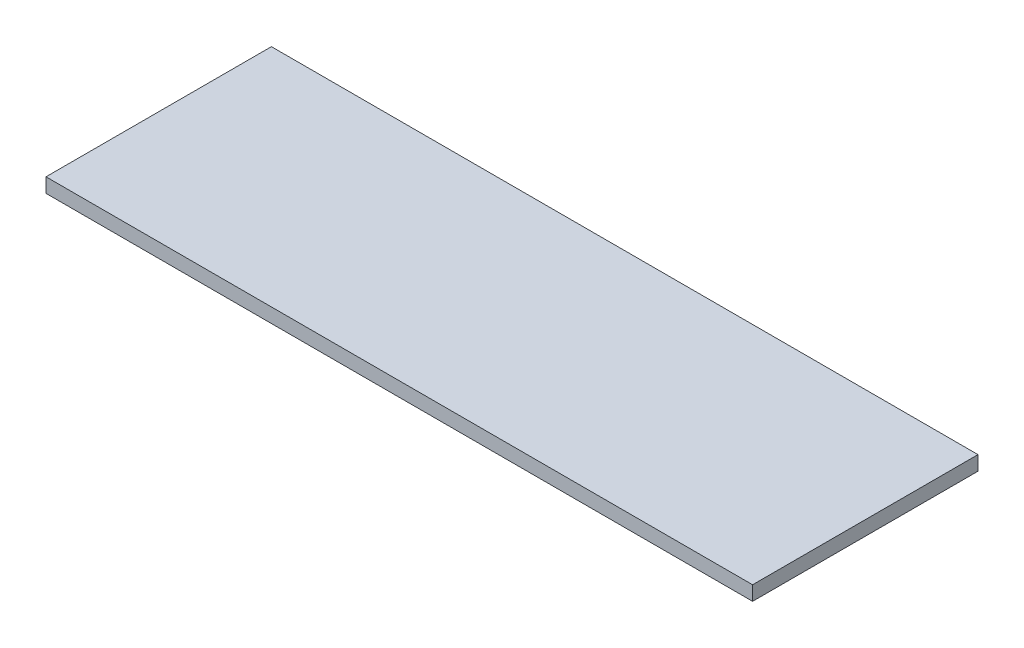
ISO-10303-21;
HEADER;
FILE_DESCRIPTION(('STEP AP214'),'2;1');
FILE_NAME('part.step','',(''),(''),'','','');
FILE_SCHEMA(('AUTOMOTIVE_DESIGN { 1 0 10303 214 1 1 1 1 }'));
ENDSEC;
DATA;
#1=APPLICATION_CONTEXT('core data for automotive mechanical design processes');
#2=APPLICATION_PROTOCOL_DEFINITION('international standard','automotive_design',2000,#1);
#3=PRODUCT_CONTEXT('',#1,'mechanical');
#4=PRODUCT('Part','Part','',(#3));
#5=PRODUCT_RELATED_PRODUCT_CATEGORY('part','',(#4));
#6=PRODUCT_DEFINITION_FORMATION('','',#4);
#7=PRODUCT_DEFINITION_CONTEXT('part definition',#1,'design');
#8=PRODUCT_DEFINITION('design','',#6,#7);
#9=PRODUCT_DEFINITION_SHAPE('','',#8);
#10=(LENGTH_UNIT() NAMED_UNIT(*) SI_UNIT(.MILLI.,.METRE.));
#11=(NAMED_UNIT(*) PLANE_ANGLE_UNIT() SI_UNIT($,.RADIAN.));
#12=(NAMED_UNIT(*) SI_UNIT($,.STERADIAN.) SOLID_ANGLE_UNIT());
#13=UNCERTAINTY_MEASURE_WITH_UNIT(LENGTH_MEASURE(1.E-05),#10,'distance_accuracy_value','');
#14=(GEOMETRIC_REPRESENTATION_CONTEXT(3) GLOBAL_UNCERTAINTY_ASSIGNED_CONTEXT((#13)) GLOBAL_UNIT_ASSIGNED_CONTEXT((#10,
#11,#12)) REPRESENTATION_CONTEXT('',''));
#15=CARTESIAN_POINT('',(0.,0.,0.));
#16=DIRECTION('',(0.,0.,1.));
#17=DIRECTION('',(1.,0.,0.));
#18=AXIS2_PLACEMENT_3D('',#15,#16,#17);
#19=CARTESIAN_POINT('',(-442.,18.,141.));
#20=DIRECTION('',(1.,0.,0.));
#21=DIRECTION('',(0.,0.,-1.));
#22=AXIS2_PLACEMENT_3D('',#19,#20,#21);
#23=PLANE('',#22);
#24=DIRECTION('',(0.,0.,1.));
#25=VECTOR('',#24,1.);
#26=CARTESIAN_POINT('',(-442.,0.,141.));
#27=LINE('',#26,#25);
#28=CARTESIAN_POINT('',(-442.,0.,-141.));
#29=VERTEX_POINT('',#28);
#30=CARTESIAN_POINT('',(-442.,0.,141.));
#31=VERTEX_POINT('',#30);
#32=EDGE_CURVE('E98',#29,#31,#27,.T.);
#33=ORIENTED_EDGE('',*,*,#32,.T.);
#34=DIRECTION('',(0.,-1.,0.));
#35=VECTOR('',#34,1.);
#36=CARTESIAN_POINT('',(-442.,18.,141.));
#37=LINE('',#36,#35);
#38=CARTESIAN_POINT('',(-442.,18.,141.));
#39=VERTEX_POINT('',#38);
#40=EDGE_CURVE('E11',#39,#31,#37,.T.);
#41=ORIENTED_EDGE('',*,*,#40,.F.);
#42=DIRECTION('',(0.,0.,1.));
#43=VECTOR('',#42,1.);
#44=CARTESIAN_POINT('',(-442.,18.,141.));
#45=LINE('',#44,#43);
#46=CARTESIAN_POINT('',(-442.,18.,-141.));
#47=VERTEX_POINT('',#46);
#48=EDGE_CURVE('E86',#47,#39,#45,.T.);
#49=ORIENTED_EDGE('',*,*,#48,.F.);
#50=DIRECTION('',(0.,-1.,0.));
#51=VECTOR('',#50,1.);
#52=CARTESIAN_POINT('',(-442.,18.,-141.));
#53=LINE('',#52,#51);
#54=EDGE_CURVE('E94',#47,#29,#53,.T.);
#55=ORIENTED_EDGE('',*,*,#54,.T.);
#56=EDGE_LOOP('',(#33,#41,#49,#55));
#57=FACE_BOUND('',#56,.T.);
#58=ADVANCED_FACE('F35',(#57),#23,.F.);
#59=CARTESIAN_POINT('',(442.,18.,141.));
#60=DIRECTION('',(0.,0.,-1.));
#61=DIRECTION('',(-1.,0.,0.));
#62=AXIS2_PLACEMENT_3D('',#59,#60,#61);
#63=PLANE('',#62);
#64=DIRECTION('',(1.,0.,0.));
#65=VECTOR('',#64,1.);
#66=CARTESIAN_POINT('',(442.,0.,141.));
#67=LINE('',#66,#65);
#68=CARTESIAN_POINT('',(442.,0.,141.));
#69=VERTEX_POINT('',#68);
#70=EDGE_CURVE('E90',#31,#69,#67,.T.);
#71=ORIENTED_EDGE('',*,*,#70,.T.);
#72=DIRECTION('',(0.,-1.,0.));
#73=VECTOR('',#72,1.);
#74=CARTESIAN_POINT('',(442.,18.,141.));
#75=LINE('',#74,#73);
#76=CARTESIAN_POINT('',(442.,18.,141.));
#77=VERTEX_POINT('',#76);
#78=EDGE_CURVE('E43',#77,#69,#75,.T.);
#79=ORIENTED_EDGE('',*,*,#78,.F.);
#80=DIRECTION('',(1.,0.,0.));
#81=VECTOR('',#80,1.);
#82=CARTESIAN_POINT('',(442.,18.,141.));
#83=LINE('',#82,#81);
#84=EDGE_CURVE('E81',#39,#77,#83,.T.);
#85=ORIENTED_EDGE('',*,*,#84,.F.);
#86=ORIENTED_EDGE('',*,*,#40,.T.);
#87=EDGE_LOOP('',(#71,#79,#85,#86));
#88=FACE_BOUND('',#87,.T.);
#89=ADVANCED_FACE('F89',(#88),#63,.F.);
#90=CARTESIAN_POINT('',(442.,18.,141.));
#91=DIRECTION('',(-1.,0.,0.));
#92=DIRECTION('',(0.,0.,1.));
#93=AXIS2_PLACEMENT_3D('',#90,#91,#92);
#94=PLANE('',#93);
#95=DIRECTION('',(0.,0.,-1.));
#96=VECTOR('',#95,1.);
#97=CARTESIAN_POINT('',(442.,0.,141.));
#98=LINE('',#97,#96);
#99=CARTESIAN_POINT('',(442.,0.,-141.));
#100=VERTEX_POINT('',#99);
#101=EDGE_CURVE('E68',#69,#100,#98,.T.);
#102=ORIENTED_EDGE('',*,*,#101,.T.);
#103=DIRECTION('',(0.,-1.,0.));
#104=VECTOR('',#103,1.);
#105=CARTESIAN_POINT('',(442.,18.,-141.));
#106=LINE('',#105,#104);
#107=CARTESIAN_POINT('',(442.,18.,-141.));
#108=VERTEX_POINT('',#107);
#109=EDGE_CURVE('E91',#108,#100,#106,.T.);
#110=ORIENTED_EDGE('',*,*,#109,.F.);
#111=DIRECTION('',(0.,0.,-1.));
#112=VECTOR('',#111,1.);
#113=CARTESIAN_POINT('',(442.,18.,141.));
#114=LINE('',#113,#112);
#115=EDGE_CURVE('E84',#77,#108,#114,.T.);
#116=ORIENTED_EDGE('',*,*,#115,.F.);
#117=ORIENTED_EDGE('',*,*,#78,.T.);
#118=EDGE_LOOP('',(#102,#110,#116,#117));
#119=FACE_BOUND('',#118,.T.);
#120=ADVANCED_FACE('F92',(#119),#94,.F.);
#121=CARTESIAN_POINT('',(442.,18.,-141.));
#122=DIRECTION('',(0.,0.,1.));
#123=DIRECTION('',(1.,0.,0.));
#124=AXIS2_PLACEMENT_3D('',#121,#122,#123);
#125=PLANE('',#124);
#126=DIRECTION('',(-1.,0.,0.));
#127=VECTOR('',#126,1.);
#128=CARTESIAN_POINT('',(442.,0.,-141.));
#129=LINE('',#128,#127);
#130=EDGE_CURVE('E74',#100,#29,#129,.T.);
#131=ORIENTED_EDGE('',*,*,#130,.T.);
#132=ORIENTED_EDGE('',*,*,#54,.F.);
#133=DIRECTION('',(-1.,0.,0.));
#134=VECTOR('',#133,1.);
#135=CARTESIAN_POINT('',(442.,18.,-141.));
#136=LINE('',#135,#134);
#137=EDGE_CURVE('E51',#108,#47,#136,.T.);
#138=ORIENTED_EDGE('',*,*,#137,.F.);
#139=ORIENTED_EDGE('',*,*,#109,.T.);
#140=EDGE_LOOP('',(#131,#132,#138,#139));
#141=FACE_BOUND('',#140,.T.);
#142=ADVANCED_FACE('F105',(#141),#125,.F.);
#143=CARTESIAN_POINT('',(0.,18.,0.));
#144=DIRECTION('',(0.,1.,0.));
#145=DIRECTION('',(0.,0.,1.));
#146=AXIS2_PLACEMENT_3D('',#143,#144,#145);
#147=PLANE('',#146);
#148=ORIENTED_EDGE('',*,*,#48,.T.);
#149=ORIENTED_EDGE('',*,*,#84,.T.);
#150=ORIENTED_EDGE('',*,*,#115,.T.);
#151=ORIENTED_EDGE('',*,*,#137,.T.);
#152=EDGE_LOOP('',(#148,#149,#150,#151));
#153=FACE_BOUND('',#152,.T.);
#154=ADVANCED_FACE('F82',(#153),#147,.T.);
#155=CARTESIAN_POINT('',(0.,0.,0.));
#156=DIRECTION('',(0.,1.,0.));
#157=DIRECTION('',(0.,0.,1.));
#158=AXIS2_PLACEMENT_3D('',#155,#156,#157);
#159=PLANE('',#158);
#160=ORIENTED_EDGE('',*,*,#32,.F.);
#161=ORIENTED_EDGE('',*,*,#130,.F.);
#162=ORIENTED_EDGE('',*,*,#101,.F.);
#163=ORIENTED_EDGE('',*,*,#70,.F.);
#164=EDGE_LOOP('',(#160,#161,#162,#163));
#165=FACE_BOUND('',#164,.T.);
#166=ADVANCED_FACE('F108',(#165),#159,.F.);
#167=CLOSED_SHELL('',(#58,#89,#120,#142,#154,#166));
#168=MANIFOLD_SOLID_BREP('B2',#167);
#169=ADVANCED_BREP_SHAPE_REPRESENTATION('',(#18,#168),#14);
#170=SHAPE_DEFINITION_REPRESENTATION(#9,#169);
ENDSEC;
END-ISO-10303-21;
